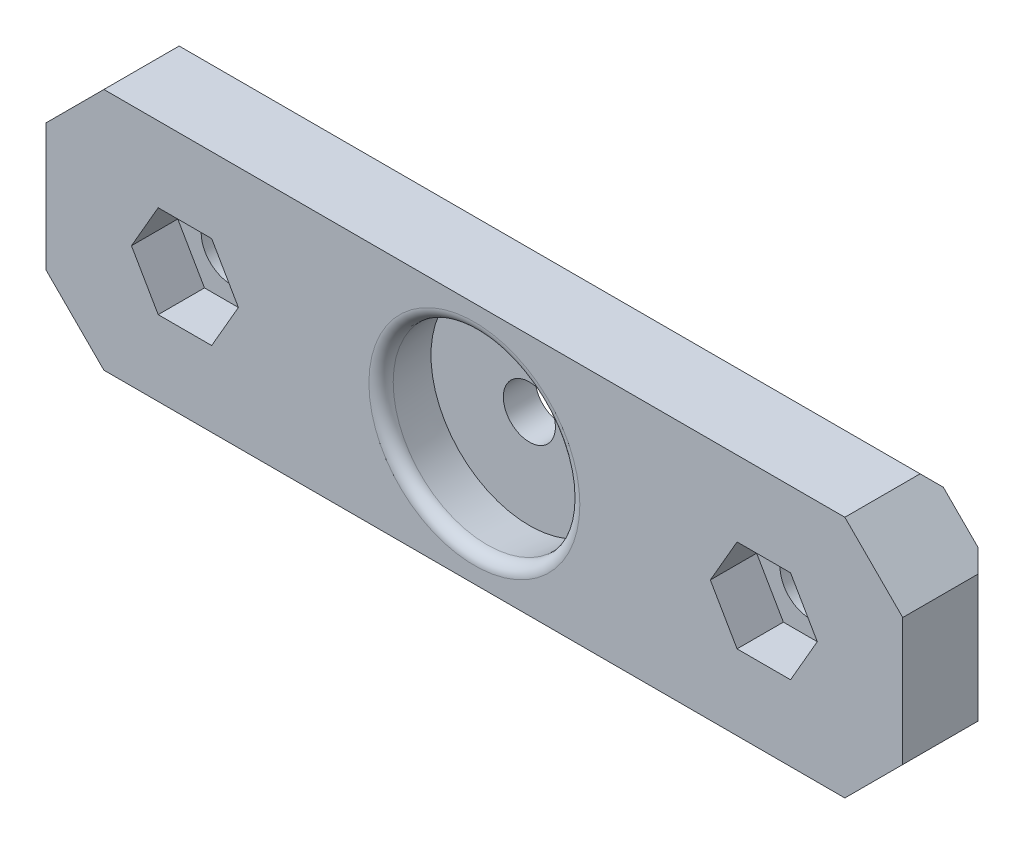
ISO-10303-21;
HEADER;
FILE_DESCRIPTION(('STEP AP214'),'2;1');
FILE_NAME('part.step','',(''),(''),'','','');
FILE_SCHEMA(('AUTOMOTIVE_DESIGN { 1 0 10303 214 1 1 1 1 }'));
ENDSEC;
DATA;
#1=APPLICATION_CONTEXT('core data for automotive mechanical design processes');
#2=APPLICATION_PROTOCOL_DEFINITION('international standard','automotive_design',2000,#1);
#3=PRODUCT_CONTEXT('',#1,'mechanical');
#4=PRODUCT('Part','Part','',(#3));
#5=PRODUCT_RELATED_PRODUCT_CATEGORY('part','',(#4));
#6=PRODUCT_DEFINITION_FORMATION('','',#4);
#7=PRODUCT_DEFINITION_CONTEXT('part definition',#1,'design');
#8=PRODUCT_DEFINITION('design','',#6,#7);
#9=PRODUCT_DEFINITION_SHAPE('','',#8);
#10=(LENGTH_UNIT() NAMED_UNIT(*) SI_UNIT(.MILLI.,.METRE.));
#11=(NAMED_UNIT(*) PLANE_ANGLE_UNIT() SI_UNIT($,.RADIAN.));
#12=(NAMED_UNIT(*) SI_UNIT($,.STERADIAN.) SOLID_ANGLE_UNIT());
#13=UNCERTAINTY_MEASURE_WITH_UNIT(LENGTH_MEASURE(1.E-05),#10,'distance_accuracy_value','');
#14=(GEOMETRIC_REPRESENTATION_CONTEXT(3) GLOBAL_UNCERTAINTY_ASSIGNED_CONTEXT((#13)) GLOBAL_UNIT_ASSIGNED_CONTEXT((#10,
#11,#12)) REPRESENTATION_CONTEXT('',''));
#15=CARTESIAN_POINT('',(0.,0.,0.));
#16=DIRECTION('',(0.,0.,1.));
#17=DIRECTION('',(1.,0.,0.));
#18=AXIS2_PLACEMENT_3D('',#15,#16,#17);
#19=CARTESIAN_POINT('',(-25.,0.,7.5));
#20=DIRECTION('',(0.,0.,-1.));
#21=DIRECTION('',(-1.,0.,0.));
#22=AXIS2_PLACEMENT_3D('',#19,#20,#21);
#23=CYLINDRICAL_SURFACE('',#22,2.6);
#24=CARTESIAN_POINT('',(-25.,0.,1.));
#25=DIRECTION('',(0.,0.,-1.));
#26=DIRECTION('',(-1.,0.,0.));
#27=AXIS2_PLACEMENT_3D('',#24,#25,#26);
#28=CIRCLE('',#27,2.6);
#29=CARTESIAN_POINT('',(-27.6,0.,1.));
#30=VERTEX_POINT('',#29);
#31=EDGE_CURVE('E362',#30,#30,#28,.T.);
#32=ORIENTED_EDGE('',*,*,#31,.T.);
#33=EDGE_LOOP('',(#32));
#34=FACE_BOUND('',#33,.T.);
#35=CARTESIAN_POINT('',(-25.,0.,3.5));
#36=DIRECTION('',(0.,0.,1.));
#37=DIRECTION('',(1.,0.,0.));
#38=AXIS2_PLACEMENT_3D('',#35,#36,#37);
#39=CIRCLE('',#38,2.6);
#40=CARTESIAN_POINT('',(-22.4,0.,3.5));
#41=VERTEX_POINT('',#40);
#42=EDGE_CURVE('E251',#41,#41,#39,.F.);
#43=ORIENTED_EDGE('',*,*,#42,.F.);
#44=EDGE_LOOP('',(#43));
#45=FACE_BOUND('',#44,.T.);
#46=ADVANCED_FACE('F33',(#34,#45),#23,.F.);
#47=CARTESIAN_POINT('',(25.,0.,7.5));
#48=DIRECTION('',(0.,0.,-1.));
#49=DIRECTION('',(-1.,0.,0.));
#50=AXIS2_PLACEMENT_3D('',#47,#48,#49);
#51=CYLINDRICAL_SURFACE('',#50,2.6);
#52=CARTESIAN_POINT('',(25.,0.,1.));
#53=DIRECTION('',(0.,0.,-1.));
#54=DIRECTION('',(-1.,0.,0.));
#55=AXIS2_PLACEMENT_3D('',#52,#53,#54);
#56=CIRCLE('',#55,2.6);
#57=CARTESIAN_POINT('',(22.4,0.,1.));
#58=VERTEX_POINT('',#57);
#59=EDGE_CURVE('E377',#58,#58,#56,.T.);
#60=ORIENTED_EDGE('',*,*,#59,.T.);
#61=EDGE_LOOP('',(#60));
#62=FACE_BOUND('',#61,.T.);
#63=CARTESIAN_POINT('',(25.,0.,3.5));
#64=DIRECTION('',(0.,0.,1.));
#65=DIRECTION('',(1.,0.,0.));
#66=AXIS2_PLACEMENT_3D('',#63,#64,#65);
#67=CIRCLE('',#66,2.6);
#68=CARTESIAN_POINT('',(27.6,0.,3.5));
#69=VERTEX_POINT('',#68);
#70=EDGE_CURVE('E297',#69,#69,#67,.F.);
#71=ORIENTED_EDGE('',*,*,#70,.F.);
#72=EDGE_LOOP('',(#71));
#73=FACE_BOUND('',#72,.T.);
#74=ADVANCED_FACE('F473',(#62,#73),#51,.F.);
#75=CARTESIAN_POINT('',(37.,-10.5,7.5));
#76=DIRECTION('',(-1.,0.,0.));
#77=DIRECTION('',(0.,0.,1.));
#78=AXIS2_PLACEMENT_3D('',#75,#76,#77);
#79=PLANE('',#78);
#80=DIRECTION('',(0.,0.,-1.));
#81=VECTOR('',#80,1.);
#82=CARTESIAN_POINT('',(37.,-5.49999999999999,7.5));
#83=LINE('',#82,#81);
#84=CARTESIAN_POINT('',(37.,-5.49999999999999,7.5));
#85=VERTEX_POINT('',#84);
#86=CARTESIAN_POINT('',(37.,-5.49999999999999,1.));
#87=VERTEX_POINT('',#86);
#88=EDGE_CURVE('E357',#85,#87,#83,.T.);
#89=ORIENTED_EDGE('',*,*,#88,.T.);
#90=DIRECTION('',(0.,1.,0.));
#91=VECTOR('',#90,1.);
#92=CARTESIAN_POINT('',(37.,5.49999999999997,1.));
#93=LINE('',#92,#91);
#94=CARTESIAN_POINT('',(37.,5.49999999999998,1.));
#95=VERTEX_POINT('',#94);
#96=EDGE_CURVE('E405',#87,#95,#93,.T.);
#97=ORIENTED_EDGE('',*,*,#96,.T.);
#98=DIRECTION('',(0.,0.,1.));
#99=VECTOR('',#98,1.);
#100=CARTESIAN_POINT('',(37.,5.49999999999998,7.5));
#101=LINE('',#100,#99);
#102=CARTESIAN_POINT('',(37.,5.49999999999997,7.5));
#103=VERTEX_POINT('',#102);
#104=EDGE_CURVE('E360',#95,#103,#101,.T.);
#105=ORIENTED_EDGE('',*,*,#104,.T.);
#106=DIRECTION('',(0.,1.,0.));
#107=VECTOR('',#106,1.);
#108=CARTESIAN_POINT('',(37.,-10.5,7.5));
#109=LINE('',#108,#107);
#110=EDGE_CURVE('E311',#85,#103,#109,.T.);
#111=ORIENTED_EDGE('',*,*,#110,.F.);
#112=EDGE_LOOP('',(#89,#97,#105,#111));
#113=FACE_BOUND('',#112,.T.);
#114=ADVANCED_FACE('F449',(#113),#79,.F.);
#115=CARTESIAN_POINT('',(-37.,10.5,7.5));
#116=DIRECTION('',(0.,-1.,0.));
#117=DIRECTION('',(0.,0.,-1.));
#118=AXIS2_PLACEMENT_3D('',#115,#116,#117);
#119=PLANE('',#118);
#120=DIRECTION('',(0.,0.,-1.));
#121=VECTOR('',#120,1.);
#122=CARTESIAN_POINT('',(32.,10.5,7.5));
#123=LINE('',#122,#121);
#124=CARTESIAN_POINT('',(32.,10.5,7.5));
#125=VERTEX_POINT('',#124);
#126=CARTESIAN_POINT('',(32.,10.5,0.999999999999995));
#127=VERTEX_POINT('',#126);
#128=EDGE_CURVE('E340',#125,#127,#123,.T.);
#129=ORIENTED_EDGE('',*,*,#128,.T.);
#130=DIRECTION('',(-1.,0.,0.));
#131=VECTOR('',#130,1.);
#132=CARTESIAN_POINT('',(-32.,10.5,0.999999999999994));
#133=LINE('',#132,#131);
#134=CARTESIAN_POINT('',(-32.,10.5,0.999999999999993));
#135=VERTEX_POINT('',#134);
#136=EDGE_CURVE('E41',#127,#135,#133,.T.);
#137=ORIENTED_EDGE('',*,*,#136,.T.);
#138=DIRECTION('',(0.,0.,1.));
#139=VECTOR('',#138,1.);
#140=CARTESIAN_POINT('',(-32.,10.5,7.5));
#141=LINE('',#140,#139);
#142=CARTESIAN_POINT('',(-32.,10.5,7.5));
#143=VERTEX_POINT('',#142);
#144=EDGE_CURVE('E342',#135,#143,#141,.T.);
#145=ORIENTED_EDGE('',*,*,#144,.T.);
#146=DIRECTION('',(-1.,0.,0.));
#147=VECTOR('',#146,1.);
#148=CARTESIAN_POINT('',(-37.,10.5,7.5));
#149=LINE('',#148,#147);
#150=EDGE_CURVE('E314',#125,#143,#149,.T.);
#151=ORIENTED_EDGE('',*,*,#150,.F.);
#152=EDGE_LOOP('',(#129,#137,#145,#151));
#153=FACE_BOUND('',#152,.T.);
#154=ADVANCED_FACE('F417',(#153),#119,.F.);
#155=CARTESIAN_POINT('',(-37.,-10.5,7.5));
#156=DIRECTION('',(1.,0.,0.));
#157=DIRECTION('',(0.,0.,-1.));
#158=AXIS2_PLACEMENT_3D('',#155,#156,#157);
#159=PLANE('',#158);
#160=DIRECTION('',(0.,0.,-1.));
#161=VECTOR('',#160,1.);
#162=CARTESIAN_POINT('',(-37.,5.5,7.5));
#163=LINE('',#162,#161);
#164=CARTESIAN_POINT('',(-37.,5.49999999999999,7.5));
#165=VERTEX_POINT('',#164);
#166=CARTESIAN_POINT('',(-37.,5.5,1.));
#167=VERTEX_POINT('',#166);
#168=EDGE_CURVE('E325',#165,#167,#163,.T.);
#169=ORIENTED_EDGE('',*,*,#168,.T.);
#170=DIRECTION('',(0.,-1.,0.));
#171=VECTOR('',#170,1.);
#172=CARTESIAN_POINT('',(-37.,-5.49999999999998,1.));
#173=LINE('',#172,#171);
#174=CARTESIAN_POINT('',(-37.,-5.49999999999997,1.));
#175=VERTEX_POINT('',#174);
#176=EDGE_CURVE('E386',#167,#175,#173,.T.);
#177=ORIENTED_EDGE('',*,*,#176,.T.);
#178=DIRECTION('',(0.,0.,1.));
#179=VECTOR('',#178,1.);
#180=CARTESIAN_POINT('',(-37.,-5.49999999999997,7.5));
#181=LINE('',#180,#179);
#182=CARTESIAN_POINT('',(-37.,-5.49999999999997,7.5));
#183=VERTEX_POINT('',#182);
#184=EDGE_CURVE('E323',#175,#183,#181,.T.);
#185=ORIENTED_EDGE('',*,*,#184,.T.);
#186=DIRECTION('',(0.,-1.,0.));
#187=VECTOR('',#186,1.);
#188=CARTESIAN_POINT('',(-37.,-10.5,7.5));
#189=LINE('',#188,#187);
#190=EDGE_CURVE('E317',#165,#183,#189,.T.);
#191=ORIENTED_EDGE('',*,*,#190,.F.);
#192=EDGE_LOOP('',(#169,#177,#185,#191));
#193=FACE_BOUND('',#192,.T.);
#194=ADVANCED_FACE('F430',(#193),#159,.F.);
#195=CARTESIAN_POINT('',(-37.,-10.5,7.5));
#196=DIRECTION('',(0.,1.,0.));
#197=DIRECTION('',(0.,0.,1.));
#198=AXIS2_PLACEMENT_3D('',#195,#196,#197);
#199=PLANE('',#198);
#200=DIRECTION('',(0.,0.,-1.));
#201=VECTOR('',#200,1.);
#202=CARTESIAN_POINT('',(-32.,-10.5,7.5));
#203=LINE('',#202,#201);
#204=CARTESIAN_POINT('',(-32.,-10.5,7.5));
#205=VERTEX_POINT('',#204);
#206=CARTESIAN_POINT('',(-32.,-10.5,0.999999999999993));
#207=VERTEX_POINT('',#206);
#208=EDGE_CURVE('E354',#205,#207,#203,.T.);
#209=ORIENTED_EDGE('',*,*,#208,.T.);
#210=DIRECTION('',(1.,0.,0.));
#211=VECTOR('',#210,1.);
#212=CARTESIAN_POINT('',(32.,-10.5,0.999999999999994));
#213=LINE('',#212,#211);
#214=CARTESIAN_POINT('',(32.,-10.5,0.999999999999993));
#215=VERTEX_POINT('',#214);
#216=EDGE_CURVE('E11',#207,#215,#213,.T.);
#217=ORIENTED_EDGE('',*,*,#216,.T.);
#218=DIRECTION('',(0.,0.,1.));
#219=VECTOR('',#218,1.);
#220=CARTESIAN_POINT('',(32.,-10.5,7.5));
#221=LINE('',#220,#219);
#222=CARTESIAN_POINT('',(32.,-10.5,7.5));
#223=VERTEX_POINT('',#222);
#224=EDGE_CURVE('E352',#215,#223,#221,.T.);
#225=ORIENTED_EDGE('',*,*,#224,.T.);
#226=DIRECTION('',(1.,0.,0.));
#227=VECTOR('',#226,1.);
#228=CARTESIAN_POINT('',(-37.,-10.5,7.5));
#229=LINE('',#228,#227);
#230=EDGE_CURVE('E320',#205,#223,#229,.T.);
#231=ORIENTED_EDGE('',*,*,#230,.F.);
#232=EDGE_LOOP('',(#209,#217,#225,#231));
#233=FACE_BOUND('',#232,.T.);
#234=ADVANCED_FACE('F440',(#233),#199,.F.);
#235=CARTESIAN_POINT('',(0.,0.,7.5));
#236=DIRECTION('',(0.,0.,-1.));
#237=DIRECTION('',(-1.,0.,0.));
#238=AXIS2_PLACEMENT_3D('',#235,#236,#237);
#239=PLANE('',#238);
#240=CARTESIAN_POINT('',(0.,0.,7.5));
#241=DIRECTION('',(0.,0.,-1.));
#242=DIRECTION('',(-1.,0.,0.));
#243=AXIS2_PLACEMENT_3D('',#240,#241,#242);
#244=CIRCLE('',#243,9.11061251482919);
#245=CARTESIAN_POINT('',(-9.11061251482919,0.,7.5));
#246=VERTEX_POINT('',#245);
#247=EDGE_CURVE('E383',#246,#246,#244,.T.);
#248=ORIENTED_EDGE('',*,*,#247,.T.);
#249=EDGE_LOOP('',(#248));
#250=FACE_BOUND('',#249,.T.);
#251=DIRECTION('',(1.,0.,0.));
#252=VECTOR('',#251,1.);
#253=CARTESIAN_POINT('',(-27.3094010767585,-4.,7.5));
#254=LINE('',#253,#252);
#255=CARTESIAN_POINT('',(-27.3094010767585,-4.,7.5));
#256=VERTEX_POINT('',#255);
#257=CARTESIAN_POINT('',(-22.6905989232415,-4.,7.5));
#258=VERTEX_POINT('',#257);
#259=EDGE_CURVE('E238',#256,#258,#254,.T.);
#260=ORIENTED_EDGE('',*,*,#259,.F.);
#261=DIRECTION('',(0.499999999999999,-0.866025403784439,0.));
#262=VECTOR('',#261,1.);
#263=CARTESIAN_POINT('',(-29.618802153517,0.,7.5));
#264=LINE('',#263,#262);
#265=CARTESIAN_POINT('',(-29.618802153517,0.,7.5));
#266=VERTEX_POINT('',#265);
#267=EDGE_CURVE('E203',#266,#256,#264,.T.);
#268=ORIENTED_EDGE('',*,*,#267,.F.);
#269=DIRECTION('',(-0.499999999999999,-0.866025403784439,0.));
#270=VECTOR('',#269,1.);
#271=CARTESIAN_POINT('',(-27.3094010767585,4.,7.5));
#272=LINE('',#271,#270);
#273=CARTESIAN_POINT('',(-27.3094010767585,4.,7.5));
#274=VERTEX_POINT('',#273);
#275=EDGE_CURVE('E222',#274,#266,#272,.T.);
#276=ORIENTED_EDGE('',*,*,#275,.F.);
#277=DIRECTION('',(-1.,0.,0.));
#278=VECTOR('',#277,1.);
#279=CARTESIAN_POINT('',(-22.6905989232415,4.,7.5));
#280=LINE('',#279,#278);
#281=CARTESIAN_POINT('',(-22.6905989232415,4.,7.5));
#282=VERTEX_POINT('',#281);
#283=EDGE_CURVE('E225',#282,#274,#280,.T.);
#284=ORIENTED_EDGE('',*,*,#283,.F.);
#285=DIRECTION('',(-0.5,0.866025403784439,0.));
#286=VECTOR('',#285,1.);
#287=CARTESIAN_POINT('',(-20.381197846483,0.,7.5));
#288=LINE('',#287,#286);
#289=CARTESIAN_POINT('',(-20.381197846483,0.,7.5));
#290=VERTEX_POINT('',#289);
#291=EDGE_CURVE('E244',#290,#282,#288,.T.);
#292=ORIENTED_EDGE('',*,*,#291,.F.);
#293=DIRECTION('',(0.5,0.866025403784439,0.));
#294=VECTOR('',#293,1.);
#295=CARTESIAN_POINT('',(-22.6905989232415,-4.,7.5));
#296=LINE('',#295,#294);
#297=EDGE_CURVE('E241',#258,#290,#296,.T.);
#298=ORIENTED_EDGE('',*,*,#297,.F.);
#299=EDGE_LOOP('',(#260,#268,#276,#284,#292,#298));
#300=FACE_BOUND('',#299,.T.);
#301=DIRECTION('',(1.,0.,0.));
#302=VECTOR('',#301,1.);
#303=CARTESIAN_POINT('',(22.6905989232415,-3.99999999999999,7.5));
#304=LINE('',#303,#302);
#305=CARTESIAN_POINT('',(22.6905989232415,-3.99999999999999,7.5));
#306=VERTEX_POINT('',#305);
#307=CARTESIAN_POINT('',(27.3094010767585,-3.99999999999999,7.5));
#308=VERTEX_POINT('',#307);
#309=EDGE_CURVE('E281',#306,#308,#304,.T.);
#310=ORIENTED_EDGE('',*,*,#309,.F.);
#311=DIRECTION('',(0.5,-0.866025403784439,0.));
#312=VECTOR('',#311,1.);
#313=CARTESIAN_POINT('',(20.381197846483,0.,7.5));
#314=LINE('',#313,#312);
#315=CARTESIAN_POINT('',(20.381197846483,0.,7.5));
#316=VERTEX_POINT('',#315);
#317=EDGE_CURVE('E279',#316,#306,#314,.T.);
#318=ORIENTED_EDGE('',*,*,#317,.F.);
#319=DIRECTION('',(-0.5,-0.866025403784439,0.));
#320=VECTOR('',#319,1.);
#321=CARTESIAN_POINT('',(22.6905989232415,4.,7.5));
#322=LINE('',#321,#320);
#323=CARTESIAN_POINT('',(22.6905989232415,4.,7.5));
#324=VERTEX_POINT('',#323);
#325=EDGE_CURVE('E263',#324,#316,#322,.T.);
#326=ORIENTED_EDGE('',*,*,#325,.F.);
#327=DIRECTION('',(-1.,0.,0.));
#328=VECTOR('',#327,1.);
#329=CARTESIAN_POINT('',(27.3094010767585,4.,7.5));
#330=LINE('',#329,#328);
#331=CARTESIAN_POINT('',(27.3094010767585,4.,7.5));
#332=VERTEX_POINT('',#331);
#333=EDGE_CURVE('E290',#332,#324,#330,.T.);
#334=ORIENTED_EDGE('',*,*,#333,.F.);
#335=DIRECTION('',(-0.5,0.866025403784439,0.));
#336=VECTOR('',#335,1.);
#337=CARTESIAN_POINT('',(29.618802153517,0.,7.5));
#338=LINE('',#337,#336);
#339=CARTESIAN_POINT('',(29.618802153517,0.,7.5));
#340=VERTEX_POINT('',#339);
#341=EDGE_CURVE('E287',#340,#332,#338,.T.);
#342=ORIENTED_EDGE('',*,*,#341,.F.);
#343=DIRECTION('',(0.5,0.866025403784438,0.));
#344=VECTOR('',#343,1.);
#345=CARTESIAN_POINT('',(27.3094010767585,-3.99999999999999,7.5));
#346=LINE('',#345,#344);
#347=EDGE_CURVE('E284',#308,#340,#346,.T.);
#348=ORIENTED_EDGE('',*,*,#347,.F.);
#349=EDGE_LOOP('',(#310,#318,#326,#334,#342,#348));
#350=FACE_BOUND('',#349,.T.);
#351=ORIENTED_EDGE('',*,*,#150,.T.);
#352=DIRECTION('',(0.707106781186549,0.707106781186547,0.));
#353=VECTOR('',#352,1.);
#354=CARTESIAN_POINT('',(-37.,5.5,7.5));
#355=LINE('',#354,#353);
#356=EDGE_CURVE('E350',#143,#165,#355,.F.);
#357=ORIENTED_EDGE('',*,*,#356,.T.);
#358=ORIENTED_EDGE('',*,*,#190,.T.);
#359=DIRECTION('',(-0.707106781186546,0.70710678118655,0.));
#360=VECTOR('',#359,1.);
#361=CARTESIAN_POINT('',(-32.,-10.5,7.5));
#362=LINE('',#361,#360);
#363=EDGE_CURVE('E348',#183,#205,#362,.F.);
#364=ORIENTED_EDGE('',*,*,#363,.T.);
#365=ORIENTED_EDGE('',*,*,#230,.T.);
#366=DIRECTION('',(-0.707106781186549,-0.707106781186547,0.));
#367=VECTOR('',#366,1.);
#368=CARTESIAN_POINT('',(37.,-5.49999999999999,7.5));
#369=LINE('',#368,#367);
#370=EDGE_CURVE('E344',#223,#85,#369,.F.);
#371=ORIENTED_EDGE('',*,*,#370,.T.);
#372=ORIENTED_EDGE('',*,*,#110,.T.);
#373=DIRECTION('',(0.707106781186545,-0.70710678118655,0.));
#374=VECTOR('',#373,1.);
#375=CARTESIAN_POINT('',(32.,10.5,7.5));
#376=LINE('',#375,#374);
#377=EDGE_CURVE('E346',#103,#125,#376,.F.);
#378=ORIENTED_EDGE('',*,*,#377,.T.);
#379=EDGE_LOOP('',(#351,#357,#358,#364,#365,#371,#372,#378));
#380=FACE_BOUND('',#379,.T.);
#381=ADVANCED_FACE('F427',(#250,#300,#350,#380),#239,.F.);
#382=CARTESIAN_POINT('',(0.,0.,0.));
#383=DIRECTION('',(0.,0.,-1.));
#384=DIRECTION('',(-1.,0.,0.));
#385=AXIS2_PLACEMENT_3D('',#382,#383,#384);
#386=PLANE('',#385);
#387=CARTESIAN_POINT('',(-25.,0.,0.));
#388=DIRECTION('',(0.,0.,-1.));
#389=DIRECTION('',(-1.,0.,0.));
#390=AXIS2_PLACEMENT_3D('',#387,#388,#389);
#391=CIRCLE('',#390,3.6);
#392=CARTESIAN_POINT('',(-28.6,0.,0.));
#393=VERTEX_POINT('',#392);
#394=EDGE_CURVE('E374',#393,#393,#391,.F.);
#395=ORIENTED_EDGE('',*,*,#394,.T.);
#396=EDGE_LOOP('',(#395));
#397=FACE_BOUND('',#396,.T.);
#398=CARTESIAN_POINT('',(25.,0.,0.));
#399=DIRECTION('',(0.,0.,-1.));
#400=DIRECTION('',(-1.,0.,0.));
#401=AXIS2_PLACEMENT_3D('',#398,#399,#400);
#402=CIRCLE('',#401,3.6);
#403=CARTESIAN_POINT('',(21.4,0.,0.));
#404=VERTEX_POINT('',#403);
#405=EDGE_CURVE('E371',#404,#404,#402,.F.);
#406=ORIENTED_EDGE('',*,*,#405,.T.);
#407=EDGE_LOOP('',(#406));
#408=FACE_BOUND('',#407,.T.);
#409=CARTESIAN_POINT('',(0.,0.,0.));
#410=DIRECTION('',(0.,0.,1.));
#411=DIRECTION('',(1.,0.,0.));
#412=AXIS2_PLACEMENT_3D('',#409,#410,#411);
#413=CIRCLE('',#412,2.25);
#414=CARTESIAN_POINT('',(2.25,0.,0.));
#415=VERTEX_POINT('',#414);
#416=EDGE_CURVE('E228',#415,#415,#413,.T.);
#417=ORIENTED_EDGE('',*,*,#416,.T.);
#418=EDGE_LOOP('',(#417));
#419=FACE_BOUND('',#418,.T.);
#420=DIRECTION('',(0.707106781186546,-0.70710678118655,0.));
#421=VECTOR('',#420,1.);
#422=CARTESIAN_POINT('',(-21.2500000000001,-21.25,0.));
#423=LINE('',#422,#421);
#424=CARTESIAN_POINT('',(-33.,-9.50000000000001,0.));
#425=VERTEX_POINT('',#424);
#426=CARTESIAN_POINT('',(-36.,-6.49999999999999,0.));
#427=VERTEX_POINT('',#426);
#428=EDGE_CURVE('E334',#425,#427,#423,.F.);
#429=ORIENTED_EDGE('',*,*,#428,.T.);
#430=DIRECTION('',(0.,1.,0.));
#431=VECTOR('',#430,1.);
#432=CARTESIAN_POINT('',(-36.,5.49999999999999,0.));
#433=LINE('',#432,#431);
#434=CARTESIAN_POINT('',(-36.,6.50000000000002,0.));
#435=VERTEX_POINT('',#434);
#436=EDGE_CURVE('E399',#427,#435,#433,.T.);
#437=ORIENTED_EDGE('',*,*,#436,.T.);
#438=DIRECTION('',(-0.707106781186549,-0.707106781186547,0.));
#439=VECTOR('',#438,1.);
#440=CARTESIAN_POINT('',(-21.2499999999999,21.25,0.));
#441=LINE('',#440,#439);
#442=CARTESIAN_POINT('',(-33.,9.50000000000001,0.));
#443=VERTEX_POINT('',#442);
#444=EDGE_CURVE('E337',#435,#443,#441,.F.);
#445=ORIENTED_EDGE('',*,*,#444,.T.);
#446=DIRECTION('',(1.,0.,0.));
#447=VECTOR('',#446,1.);
#448=CARTESIAN_POINT('',(32.,9.50000000000001,0.));
#449=LINE('',#448,#447);
#450=CARTESIAN_POINT('',(33.,9.50000000000001,0.));
#451=VERTEX_POINT('',#450);
#452=EDGE_CURVE('E395',#443,#451,#449,.T.);
#453=ORIENTED_EDGE('',*,*,#452,.T.);
#454=DIRECTION('',(-0.707106781186545,0.70710678118655,0.));
#455=VECTOR('',#454,1.);
#456=CARTESIAN_POINT('',(21.2500000000001,21.25,0.));
#457=LINE('',#456,#455);
#458=CARTESIAN_POINT('',(36.,6.49999999999998,0.));
#459=VERTEX_POINT('',#458);
#460=EDGE_CURVE('E331',#451,#459,#457,.F.);
#461=ORIENTED_EDGE('',*,*,#460,.T.);
#462=DIRECTION('',(0.,-1.,0.));
#463=VECTOR('',#462,1.);
#464=CARTESIAN_POINT('',(36.,-5.49999999999999,0.));
#465=LINE('',#464,#463);
#466=CARTESIAN_POINT('',(36.,-6.50000000000002,0.));
#467=VERTEX_POINT('',#466);
#468=EDGE_CURVE('E397',#459,#467,#465,.T.);
#469=ORIENTED_EDGE('',*,*,#468,.T.);
#470=DIRECTION('',(0.707106781186549,0.707106781186547,0.));
#471=VECTOR('',#470,1.);
#472=CARTESIAN_POINT('',(21.25,-21.25,0.));
#473=LINE('',#472,#471);
#474=CARTESIAN_POINT('',(33.,-9.5,0.));
#475=VERTEX_POINT('',#474);
#476=EDGE_CURVE('E328',#467,#475,#473,.F.);
#477=ORIENTED_EDGE('',*,*,#476,.T.);
#478=DIRECTION('',(-1.,0.,0.));
#479=VECTOR('',#478,1.);
#480=CARTESIAN_POINT('',(-32.,-9.50000000000001,0.));
#481=LINE('',#480,#479);
#482=EDGE_CURVE('E393',#475,#425,#481,.T.);
#483=ORIENTED_EDGE('',*,*,#482,.T.);
#484=EDGE_LOOP('',(#429,#437,#445,#453,#461,#469,#477,#483));
#485=FACE_BOUND('',#484,.T.);
#486=ADVANCED_FACE('F456',(#397,#408,#419,#485),#386,.T.);
#487=CARTESIAN_POINT('',(0.,0.,7.5));
#488=DIRECTION('',(0.,0.,-1.));
#489=DIRECTION('',(1.,0.,0.));
#490=AXIS2_PLACEMENT_3D('',#487,#488,#489);
#491=CONICAL_SURFACE('',#490,8.,0.10471975511966);
#492=CARTESIAN_POINT('',(0.,0.,6.39547153673234));
#493=DIRECTION('',(0.,0.,1.));
#494=DIRECTION('',(1.,0.,0.));
#495=AXIS2_PLACEMENT_3D('',#492,#493,#494);
#496=CIRCLE('',#495,8.11609061946092);
#497=CARTESIAN_POINT('',(8.11609061946092,0.,6.39547153673234));
#498=VERTEX_POINT('',#497);
#499=EDGE_CURVE('E380',#498,#498,#496,.T.);
#500=ORIENTED_EDGE('',*,*,#499,.T.);
#501=EDGE_LOOP('',(#500));
#502=FACE_BOUND('',#501,.T.);
#503=CARTESIAN_POINT('',(0.,0.,2.75));
#504=DIRECTION('',(0.,0.,1.));
#505=DIRECTION('',(1.,0.,0.));
#506=AXIS2_PLACEMENT_3D('',#503,#504,#505);
#507=CIRCLE('',#506,8.49924511751196);
#508=CARTESIAN_POINT('',(8.49924511751196,0.,2.75));
#509=VERTEX_POINT('',#508);
#510=EDGE_CURVE('E308',#509,#509,#507,.T.);
#511=ORIENTED_EDGE('',*,*,#510,.F.);
#512=EDGE_LOOP('',(#511));
#513=FACE_BOUND('',#512,.T.);
#514=ADVANCED_FACE('F489',(#502,#513),#491,.F.);
#515=CARTESIAN_POINT('',(0.,0.,2.75));
#516=DIRECTION('',(0.,0.,1.));
#517=DIRECTION('',(1.,0.,0.));
#518=AXIS2_PLACEMENT_3D('',#515,#516,#517);
#519=PLANE('',#518);
#520=CARTESIAN_POINT('',(0.,0.,2.75));
#521=DIRECTION('',(0.,0.,1.));
#522=DIRECTION('',(1.,0.,0.));
#523=AXIS2_PLACEMENT_3D('',#520,#521,#522);
#524=CIRCLE('',#523,2.25);
#525=CARTESIAN_POINT('',(2.25,0.,2.75));
#526=VERTEX_POINT('',#525);
#527=EDGE_CURVE('E239',#526,#526,#524,.T.);
#528=ORIENTED_EDGE('',*,*,#527,.F.);
#529=EDGE_LOOP('',(#528));
#530=FACE_BOUND('',#529,.T.);
#531=ORIENTED_EDGE('',*,*,#510,.T.);
#532=EDGE_LOOP('',(#531));
#533=FACE_BOUND('',#532,.T.);
#534=ADVANCED_FACE('F486',(#530,#533),#519,.T.);
#535=CARTESIAN_POINT('',(-37.,5.5,7.5));
#536=DIRECTION('',(0.707106781186547,-0.707106781186549,0.));
#537=DIRECTION('',(0.,0.,-1.));
#538=AXIS2_PLACEMENT_3D('',#535,#536,#537);
#539=PLANE('',#538);
#540=ORIENTED_EDGE('',*,*,#444,.F.);
#541=DIRECTION('',(0.577350269189628,0.577350269189626,-0.577350269189624));
#542=VECTOR('',#541,1.);
#543=CARTESIAN_POINT('',(-39.1666666666667,3.33333333333334,3.16666666666665));
#544=LINE('',#543,#542);
#545=EDGE_CURVE('E403',#435,#167,#544,.F.);
#546=ORIENTED_EDGE('',*,*,#545,.T.);
#547=ORIENTED_EDGE('',*,*,#168,.F.);
#548=ORIENTED_EDGE('',*,*,#356,.F.);
#549=ORIENTED_EDGE('',*,*,#144,.F.);
#550=DIRECTION('',(0.577350269189627,0.577350269189625,0.577350269189625));
#551=VECTOR('',#550,1.);
#552=CARTESIAN_POINT('',(-33.1666666666667,9.33333333333333,-0.16666666666668));
#553=LINE('',#552,#551);
#554=EDGE_CURVE('E401',#135,#443,#553,.F.);
#555=ORIENTED_EDGE('',*,*,#554,.T.);
#556=EDGE_LOOP('',(#540,#546,#547,#548,#549,#555));
#557=FACE_BOUND('',#556,.T.);
#558=ADVANCED_FACE('F423',(#557),#539,.F.);
#559=CARTESIAN_POINT('',(-32.,-10.5,7.5));
#560=DIRECTION('',(0.70710678118655,0.707106781186546,0.));
#561=DIRECTION('',(0.,0.,-1.));
#562=AXIS2_PLACEMENT_3D('',#559,#560,#561);
#563=PLANE('',#562);
#564=ORIENTED_EDGE('',*,*,#184,.F.);
#565=DIRECTION('',(-0.577350269189626,0.577350269189629,0.577350269189622));
#566=VECTOR('',#565,1.);
#567=CARTESIAN_POINT('',(-35.8333333333333,-6.66666666666668,-0.166666666666691));
#568=LINE('',#567,#566);
#569=EDGE_CURVE('E391',#175,#427,#568,.F.);
#570=ORIENTED_EDGE('',*,*,#569,.T.);
#571=ORIENTED_EDGE('',*,*,#428,.F.);
#572=DIRECTION('',(-0.577350269189624,0.577350269189627,-0.577350269189627));
#573=VECTOR('',#572,1.);
#574=CARTESIAN_POINT('',(-29.8333333333333,-12.6666666666667,3.16666666666667));
#575=LINE('',#574,#573);
#576=EDGE_CURVE('E389',#425,#207,#575,.F.);
#577=ORIENTED_EDGE('',*,*,#576,.T.);
#578=ORIENTED_EDGE('',*,*,#208,.F.);
#579=ORIENTED_EDGE('',*,*,#363,.F.);
#580=EDGE_LOOP('',(#564,#570,#571,#577,#578,#579));
#581=FACE_BOUND('',#580,.T.);
#582=ADVANCED_FACE('F434',(#581),#563,.F.);
#583=CARTESIAN_POINT('',(32.,10.5,7.5));
#584=DIRECTION('',(-0.70710678118655,-0.707106781186545,0.));
#585=DIRECTION('',(0.,0.,-1.));
#586=AXIS2_PLACEMENT_3D('',#583,#584,#585);
#587=PLANE('',#586);
#588=ORIENTED_EDGE('',*,*,#104,.F.);
#589=DIRECTION('',(0.577350269189626,-0.57735026918963,0.577350269189622));
#590=VECTOR('',#589,1.);
#591=CARTESIAN_POINT('',(35.8333333333333,6.66666666666669,-0.166666666666687));
#592=LINE('',#591,#590);
#593=EDGE_CURVE('E409',#95,#459,#592,.F.);
#594=ORIENTED_EDGE('',*,*,#593,.T.);
#595=ORIENTED_EDGE('',*,*,#460,.F.);
#596=DIRECTION('',(0.577350269189623,-0.577350269189627,-0.577350269189627));
#597=VECTOR('',#596,1.);
#598=CARTESIAN_POINT('',(29.8333333333333,12.6666666666667,3.16666666666667));
#599=LINE('',#598,#597);
#600=EDGE_CURVE('E55',#451,#127,#599,.F.);
#601=ORIENTED_EDGE('',*,*,#600,.T.);
#602=ORIENTED_EDGE('',*,*,#128,.F.);
#603=ORIENTED_EDGE('',*,*,#377,.F.);
#604=EDGE_LOOP('',(#588,#594,#595,#601,#602,#603));
#605=FACE_BOUND('',#604,.T.);
#606=ADVANCED_FACE('F452',(#605),#587,.F.);
#607=CARTESIAN_POINT('',(37.,-5.49999999999999,7.5));
#608=DIRECTION('',(-0.707106781186547,0.707106781186549,0.));
#609=DIRECTION('',(0.,0.,-1.));
#610=AXIS2_PLACEMENT_3D('',#607,#608,#609);
#611=PLANE('',#610);
#612=ORIENTED_EDGE('',*,*,#476,.F.);
#613=DIRECTION('',(-0.577350269189628,-0.577350269189626,-0.577350269189624));
#614=VECTOR('',#613,1.);
#615=CARTESIAN_POINT('',(39.1666666666667,-3.33333333333334,3.16666666666665));
#616=LINE('',#615,#614);
#617=EDGE_CURVE('E412',#467,#87,#616,.F.);
#618=ORIENTED_EDGE('',*,*,#617,.T.);
#619=ORIENTED_EDGE('',*,*,#88,.F.);
#620=ORIENTED_EDGE('',*,*,#370,.F.);
#621=ORIENTED_EDGE('',*,*,#224,.F.);
#622=DIRECTION('',(-0.577350269189627,-0.577350269189625,0.577350269189625));
#623=VECTOR('',#622,1.);
#624=CARTESIAN_POINT('',(33.1666666666667,-9.33333333333332,-0.16666666666668));
#625=LINE('',#624,#623);
#626=EDGE_CURVE('E48',#215,#475,#625,.F.);
#627=ORIENTED_EDGE('',*,*,#626,.T.);
#628=EDGE_LOOP('',(#612,#618,#619,#620,#621,#627));
#629=FACE_BOUND('',#628,.T.);
#630=ADVANCED_FACE('F444',(#629),#611,.F.);
#631=CARTESIAN_POINT('',(0.,0.,3.5));
#632=DIRECTION('',(0.,0.,1.));
#633=DIRECTION('',(1.,0.,0.));
#634=AXIS2_PLACEMENT_3D('',#631,#632,#633);
#635=PLANE('',#634);
#636=DIRECTION('',(0.5,-0.866025403784439,0.));
#637=VECTOR('',#636,1.);
#638=CARTESIAN_POINT('',(20.381197846483,0.,3.5));
#639=LINE('',#638,#637);
#640=CARTESIAN_POINT('',(20.381197846483,0.,3.5));
#641=VERTEX_POINT('',#640);
#642=CARTESIAN_POINT('',(22.6905989232415,-3.99999999999999,3.5));
#643=VERTEX_POINT('',#642);
#644=EDGE_CURVE('E259',#641,#643,#639,.T.);
#645=ORIENTED_EDGE('',*,*,#644,.T.);
#646=DIRECTION('',(1.,0.,0.));
#647=VECTOR('',#646,1.);
#648=CARTESIAN_POINT('',(22.6905989232415,-3.99999999999999,3.5));
#649=LINE('',#648,#647);
#650=CARTESIAN_POINT('',(27.3094010767585,-3.99999999999999,3.5));
#651=VERTEX_POINT('',#650);
#652=EDGE_CURVE('E262',#643,#651,#649,.T.);
#653=ORIENTED_EDGE('',*,*,#652,.T.);
#654=DIRECTION('',(0.5,0.866025403784438,0.));
#655=VECTOR('',#654,1.);
#656=CARTESIAN_POINT('',(27.3094010767585,-3.99999999999999,3.5));
#657=LINE('',#656,#655);
#658=CARTESIAN_POINT('',(29.618802153517,0.,3.5));
#659=VERTEX_POINT('',#658);
#660=EDGE_CURVE('E266',#651,#659,#657,.T.);
#661=ORIENTED_EDGE('',*,*,#660,.T.);
#662=DIRECTION('',(-0.5,0.866025403784439,0.));
#663=VECTOR('',#662,1.);
#664=CARTESIAN_POINT('',(29.618802153517,0.,3.5));
#665=LINE('',#664,#663);
#666=CARTESIAN_POINT('',(27.3094010767585,4.,3.5));
#667=VERTEX_POINT('',#666);
#668=EDGE_CURVE('E269',#659,#667,#665,.T.);
#669=ORIENTED_EDGE('',*,*,#668,.T.);
#670=DIRECTION('',(-1.,0.,0.));
#671=VECTOR('',#670,1.);
#672=CARTESIAN_POINT('',(27.3094010767585,4.,3.5));
#673=LINE('',#672,#671);
#674=CARTESIAN_POINT('',(22.6905989232415,4.,3.5));
#675=VERTEX_POINT('',#674);
#676=EDGE_CURVE('E272',#667,#675,#673,.T.);
#677=ORIENTED_EDGE('',*,*,#676,.T.);
#678=DIRECTION('',(-0.5,-0.866025403784439,0.));
#679=VECTOR('',#678,1.);
#680=CARTESIAN_POINT('',(22.6905989232415,4.,3.5));
#681=LINE('',#680,#679);
#682=EDGE_CURVE('E275',#675,#641,#681,.T.);
#683=ORIENTED_EDGE('',*,*,#682,.T.);
#684=EDGE_LOOP('',(#645,#653,#661,#669,#677,#683));
#685=FACE_BOUND('',#684,.T.);
#686=ORIENTED_EDGE('',*,*,#70,.T.);
#687=EDGE_LOOP('',(#686));
#688=FACE_BOUND('',#687,.T.);
#689=ADVANCED_FACE('F516',(#685,#688),#635,.T.);
#690=CARTESIAN_POINT('',(20.381197846483,0.,3.5));
#691=DIRECTION('',(-0.866025403784439,-0.5,0.));
#692=DIRECTION('',(0.5,-0.866025403784439,0.));
#693=AXIS2_PLACEMENT_3D('',#690,#691,#692);
#694=PLANE('',#693);
#695=ORIENTED_EDGE('',*,*,#317,.T.);
#696=DIRECTION('',(0.,0.,1.));
#697=VECTOR('',#696,1.);
#698=CARTESIAN_POINT('',(22.6905989232415,-3.99999999999999,3.5));
#699=LINE('',#698,#697);
#700=EDGE_CURVE('E278',#643,#306,#699,.T.);
#701=ORIENTED_EDGE('',*,*,#700,.F.);
#702=ORIENTED_EDGE('',*,*,#644,.F.);
#703=DIRECTION('',(0.,0.,1.));
#704=VECTOR('',#703,1.);
#705=CARTESIAN_POINT('',(20.381197846483,0.,3.5));
#706=LINE('',#705,#704);
#707=EDGE_CURVE('E295',#641,#316,#706,.T.);
#708=ORIENTED_EDGE('',*,*,#707,.T.);
#709=EDGE_LOOP('',(#695,#701,#702,#708));
#710=FACE_BOUND('',#709,.T.);
#711=ADVANCED_FACE('F483',(#710),#694,.F.);
#712=CARTESIAN_POINT('',(22.6905989232415,4.,3.5));
#713=DIRECTION('',(-0.866025403784439,0.499999999999999,0.));
#714=DIRECTION('',(-0.499999999999999,-0.866025403784439,0.));
#715=AXIS2_PLACEMENT_3D('',#712,#713,#714);
#716=PLANE('',#715);
#717=ORIENTED_EDGE('',*,*,#325,.T.);
#718=ORIENTED_EDGE('',*,*,#707,.F.);
#719=ORIENTED_EDGE('',*,*,#682,.F.);
#720=DIRECTION('',(0.,0.,1.));
#721=VECTOR('',#720,1.);
#722=CARTESIAN_POINT('',(22.6905989232415,4.,3.5));
#723=LINE('',#722,#721);
#724=EDGE_CURVE('E298',#675,#324,#723,.T.);
#725=ORIENTED_EDGE('',*,*,#724,.T.);
#726=EDGE_LOOP('',(#717,#718,#719,#725));
#727=FACE_BOUND('',#726,.T.);
#728=ADVANCED_FACE('F673',(#727),#716,.F.);
#729=CARTESIAN_POINT('',(27.3094010767585,4.,3.5));
#730=DIRECTION('',(0.,1.,0.));
#731=DIRECTION('',(-1.,0.,0.));
#732=AXIS2_PLACEMENT_3D('',#729,#730,#731);
#733=PLANE('',#732);
#734=ORIENTED_EDGE('',*,*,#333,.T.);
#735=ORIENTED_EDGE('',*,*,#724,.F.);
#736=ORIENTED_EDGE('',*,*,#676,.F.);
#737=DIRECTION('',(0.,0.,1.));
#738=VECTOR('',#737,1.);
#739=CARTESIAN_POINT('',(27.3094010767585,4.,3.5));
#740=LINE('',#739,#738);
#741=EDGE_CURVE('E300',#667,#332,#740,.T.);
#742=ORIENTED_EDGE('',*,*,#741,.T.);
#743=EDGE_LOOP('',(#734,#735,#736,#742));
#744=FACE_BOUND('',#743,.T.);
#745=ADVANCED_FACE('F664',(#744),#733,.F.);
#746=CARTESIAN_POINT('',(29.618802153517,0.,3.5));
#747=DIRECTION('',(0.866025403784439,0.5,0.));
#748=DIRECTION('',(-0.5,0.866025403784439,0.));
#749=AXIS2_PLACEMENT_3D('',#746,#747,#748);
#750=PLANE('',#749);
#751=ORIENTED_EDGE('',*,*,#341,.T.);
#752=ORIENTED_EDGE('',*,*,#741,.F.);
#753=ORIENTED_EDGE('',*,*,#668,.F.);
#754=DIRECTION('',(0.,0.,1.));
#755=VECTOR('',#754,1.);
#756=CARTESIAN_POINT('',(29.618802153517,0.,3.5));
#757=LINE('',#756,#755);
#758=EDGE_CURVE('E302',#659,#340,#757,.T.);
#759=ORIENTED_EDGE('',*,*,#758,.T.);
#760=EDGE_LOOP('',(#751,#752,#753,#759));
#761=FACE_BOUND('',#760,.T.);
#762=ADVANCED_FACE('F655',(#761),#750,.F.);
#763=CARTESIAN_POINT('',(27.3094010767585,-3.99999999999999,3.5));
#764=DIRECTION('',(0.866025403784439,-0.5,0.));
#765=DIRECTION('',(0.5,0.866025403784438,0.));
#766=AXIS2_PLACEMENT_3D('',#763,#764,#765);
#767=PLANE('',#766);
#768=ORIENTED_EDGE('',*,*,#347,.T.);
#769=ORIENTED_EDGE('',*,*,#758,.F.);
#770=ORIENTED_EDGE('',*,*,#660,.F.);
#771=DIRECTION('',(0.,0.,1.));
#772=VECTOR('',#771,1.);
#773=CARTESIAN_POINT('',(27.3094010767585,-3.99999999999999,3.5));
#774=LINE('',#773,#772);
#775=EDGE_CURVE('E304',#651,#308,#774,.T.);
#776=ORIENTED_EDGE('',*,*,#775,.T.);
#777=EDGE_LOOP('',(#768,#769,#770,#776));
#778=FACE_BOUND('',#777,.T.);
#779=ADVANCED_FACE('F647',(#778),#767,.F.);
#780=CARTESIAN_POINT('',(22.6905989232415,-3.99999999999999,3.5));
#781=DIRECTION('',(0.,-1.,0.));
#782=DIRECTION('',(0.,0.,-1.));
#783=AXIS2_PLACEMENT_3D('',#780,#781,#782);
#784=PLANE('',#783);
#785=ORIENTED_EDGE('',*,*,#309,.T.);
#786=ORIENTED_EDGE('',*,*,#775,.F.);
#787=ORIENTED_EDGE('',*,*,#652,.F.);
#788=ORIENTED_EDGE('',*,*,#700,.T.);
#789=EDGE_LOOP('',(#785,#786,#787,#788));
#790=FACE_BOUND('',#789,.T.);
#791=ADVANCED_FACE('F639',(#790),#784,.F.);
#792=CARTESIAN_POINT('',(0.,0.,3.5));
#793=DIRECTION('',(0.,0.,1.));
#794=DIRECTION('',(1.,0.,0.));
#795=AXIS2_PLACEMENT_3D('',#792,#793,#794);
#796=PLANE('',#795);
#797=DIRECTION('',(0.499999999999999,-0.866025403784439,0.));
#798=VECTOR('',#797,1.);
#799=CARTESIAN_POINT('',(-29.618802153517,0.,3.5));
#800=LINE('',#799,#798);
#801=CARTESIAN_POINT('',(-29.618802153517,0.,3.5));
#802=VERTEX_POINT('',#801);
#803=CARTESIAN_POINT('',(-27.3094010767585,-4.,3.5));
#804=VERTEX_POINT('',#803);
#805=EDGE_CURVE('E200',#802,#804,#800,.T.);
#806=ORIENTED_EDGE('',*,*,#805,.T.);
#807=DIRECTION('',(1.,0.,0.));
#808=VECTOR('',#807,1.);
#809=CARTESIAN_POINT('',(-27.3094010767585,-4.,3.5));
#810=LINE('',#809,#808);
#811=CARTESIAN_POINT('',(-22.6905989232415,-4.,3.5));
#812=VERTEX_POINT('',#811);
#813=EDGE_CURVE('E211',#804,#812,#810,.T.);
#814=ORIENTED_EDGE('',*,*,#813,.T.);
#815=DIRECTION('',(0.5,0.866025403784439,0.));
#816=VECTOR('',#815,1.);
#817=CARTESIAN_POINT('',(-22.6905989232415,-4.,3.5));
#818=LINE('',#817,#816);
#819=CARTESIAN_POINT('',(-20.381197846483,0.,3.5));
#820=VERTEX_POINT('',#819);
#821=EDGE_CURVE('E216',#812,#820,#818,.T.);
#822=ORIENTED_EDGE('',*,*,#821,.T.);
#823=DIRECTION('',(-0.5,0.866025403784439,0.));
#824=VECTOR('',#823,1.);
#825=CARTESIAN_POINT('',(-20.381197846483,0.,3.5));
#826=LINE('',#825,#824);
#827=CARTESIAN_POINT('',(-22.6905989232415,4.,3.5));
#828=VERTEX_POINT('',#827);
#829=EDGE_CURVE('E231',#820,#828,#826,.T.);
#830=ORIENTED_EDGE('',*,*,#829,.T.);
#831=DIRECTION('',(-1.,0.,0.));
#832=VECTOR('',#831,1.);
#833=CARTESIAN_POINT('',(-22.6905989232415,4.,3.5));
#834=LINE('',#833,#832);
#835=CARTESIAN_POINT('',(-27.3094010767585,4.,3.5));
#836=VERTEX_POINT('',#835);
#837=EDGE_CURVE('E234',#828,#836,#834,.T.);
#838=ORIENTED_EDGE('',*,*,#837,.T.);
#839=DIRECTION('',(-0.499999999999999,-0.866025403784439,0.));
#840=VECTOR('',#839,1.);
#841=CARTESIAN_POINT('',(-27.3094010767585,4.,3.5));
#842=LINE('',#841,#840);
#843=EDGE_CURVE('E208',#836,#802,#842,.T.);
#844=ORIENTED_EDGE('',*,*,#843,.T.);
#845=EDGE_LOOP('',(#806,#814,#822,#830,#838,#844));
#846=FACE_BOUND('',#845,.T.);
#847=ORIENTED_EDGE('',*,*,#42,.T.);
#848=EDGE_LOOP('',(#847));
#849=FACE_BOUND('',#848,.T.);
#850=ADVANCED_FACE('F218',(#846,#849),#796,.T.);
#851=CARTESIAN_POINT('',(-29.618802153517,0.,3.5));
#852=DIRECTION('',(-0.866025403784439,-0.499999999999999,0.));
#853=DIRECTION('',(0.5,-0.866025403784439,0.));
#854=AXIS2_PLACEMENT_3D('',#851,#852,#853);
#855=PLANE('',#854);
#856=ORIENTED_EDGE('',*,*,#267,.T.);
#857=DIRECTION('',(0.,0.,1.));
#858=VECTOR('',#857,1.);
#859=CARTESIAN_POINT('',(-27.3094010767585,-4.,3.5));
#860=LINE('',#859,#858);
#861=EDGE_CURVE('E196',#804,#256,#860,.T.);
#862=ORIENTED_EDGE('',*,*,#861,.F.);
#863=ORIENTED_EDGE('',*,*,#805,.F.);
#864=DIRECTION('',(0.,0.,1.));
#865=VECTOR('',#864,1.);
#866=CARTESIAN_POINT('',(-29.618802153517,0.,3.5));
#867=LINE('',#866,#865);
#868=EDGE_CURVE('E249',#802,#266,#867,.T.);
#869=ORIENTED_EDGE('',*,*,#868,.T.);
#870=EDGE_LOOP('',(#856,#862,#863,#869));
#871=FACE_BOUND('',#870,.T.);
#872=ADVANCED_FACE('F198',(#871),#855,.F.);
#873=CARTESIAN_POINT('',(-27.3094010767585,4.,3.5));
#874=DIRECTION('',(-0.866025403784439,0.499999999999999,0.));
#875=DIRECTION('',(-0.499999999999999,-0.866025403784439,0.));
#876=AXIS2_PLACEMENT_3D('',#873,#874,#875);
#877=PLANE('',#876);
#878=ORIENTED_EDGE('',*,*,#275,.T.);
#879=ORIENTED_EDGE('',*,*,#868,.F.);
#880=ORIENTED_EDGE('',*,*,#843,.F.);
#881=DIRECTION('',(0.,0.,1.));
#882=VECTOR('',#881,1.);
#883=CARTESIAN_POINT('',(-27.3094010767585,4.,3.5));
#884=LINE('',#883,#882);
#885=EDGE_CURVE('E252',#836,#274,#884,.T.);
#886=ORIENTED_EDGE('',*,*,#885,.T.);
#887=EDGE_LOOP('',(#878,#879,#880,#886));
#888=FACE_BOUND('',#887,.T.);
#889=ADVANCED_FACE('F615',(#888),#877,.F.);
#890=CARTESIAN_POINT('',(-22.6905989232415,4.,3.5));
#891=DIRECTION('',(0.,1.,0.));
#892=DIRECTION('',(-1.,0.,0.));
#893=AXIS2_PLACEMENT_3D('',#890,#891,#892);
#894=PLANE('',#893);
#895=ORIENTED_EDGE('',*,*,#283,.T.);
#896=ORIENTED_EDGE('',*,*,#885,.F.);
#897=ORIENTED_EDGE('',*,*,#837,.F.);
#898=DIRECTION('',(0.,0.,1.));
#899=VECTOR('',#898,1.);
#900=CARTESIAN_POINT('',(-22.6905989232415,4.,3.5));
#901=LINE('',#900,#899);
#902=EDGE_CURVE('E254',#828,#282,#901,.T.);
#903=ORIENTED_EDGE('',*,*,#902,.T.);
#904=EDGE_LOOP('',(#895,#896,#897,#903));
#905=FACE_BOUND('',#904,.T.);
#906=ADVANCED_FACE('F606',(#905),#894,.F.);
#907=CARTESIAN_POINT('',(-20.381197846483,0.,3.5));
#908=DIRECTION('',(0.866025403784439,0.5,0.));
#909=DIRECTION('',(-0.5,0.866025403784439,0.));
#910=AXIS2_PLACEMENT_3D('',#907,#908,#909);
#911=PLANE('',#910);
#912=ORIENTED_EDGE('',*,*,#291,.T.);
#913=ORIENTED_EDGE('',*,*,#902,.F.);
#914=ORIENTED_EDGE('',*,*,#829,.F.);
#915=DIRECTION('',(0.,0.,1.));
#916=VECTOR('',#915,1.);
#917=CARTESIAN_POINT('',(-20.381197846483,0.,3.5));
#918=LINE('',#917,#916);
#919=EDGE_CURVE('E256',#820,#290,#918,.T.);
#920=ORIENTED_EDGE('',*,*,#919,.T.);
#921=EDGE_LOOP('',(#912,#913,#914,#920));
#922=FACE_BOUND('',#921,.T.);
#923=ADVANCED_FACE('F597',(#922),#911,.F.);
#924=CARTESIAN_POINT('',(-22.6905989232415,-4.,3.5));
#925=DIRECTION('',(0.866025403784439,-0.5,0.));
#926=DIRECTION('',(0.5,0.866025403784439,0.));
#927=AXIS2_PLACEMENT_3D('',#924,#925,#926);
#928=PLANE('',#927);
#929=ORIENTED_EDGE('',*,*,#297,.T.);
#930=ORIENTED_EDGE('',*,*,#919,.F.);
#931=ORIENTED_EDGE('',*,*,#821,.F.);
#932=DIRECTION('',(0.,0.,1.));
#933=VECTOR('',#932,1.);
#934=CARTESIAN_POINT('',(-22.6905989232415,-4.,3.5));
#935=LINE('',#934,#933);
#936=EDGE_CURVE('E207',#812,#258,#935,.T.);
#937=ORIENTED_EDGE('',*,*,#936,.T.);
#938=EDGE_LOOP('',(#929,#930,#931,#937));
#939=FACE_BOUND('',#938,.T.);
#940=ADVANCED_FACE('F589',(#939),#928,.F.);
#941=CARTESIAN_POINT('',(-27.3094010767585,-4.,3.5));
#942=DIRECTION('',(0.,-1.,0.));
#943=DIRECTION('',(0.,0.,-1.));
#944=AXIS2_PLACEMENT_3D('',#941,#942,#943);
#945=PLANE('',#944);
#946=ORIENTED_EDGE('',*,*,#259,.T.);
#947=ORIENTED_EDGE('',*,*,#936,.F.);
#948=ORIENTED_EDGE('',*,*,#813,.F.);
#949=ORIENTED_EDGE('',*,*,#861,.T.);
#950=EDGE_LOOP('',(#946,#947,#948,#949));
#951=FACE_BOUND('',#950,.T.);
#952=ADVANCED_FACE('F212',(#951),#945,.F.);
#953=CARTESIAN_POINT('',(0.,0.,0.));
#954=DIRECTION('',(0.,0.,1.));
#955=DIRECTION('',(1.,0.,0.));
#956=AXIS2_PLACEMENT_3D('',#953,#954,#955);
#957=CYLINDRICAL_SURFACE('',#956,2.25);
#958=ORIENTED_EDGE('',*,*,#527,.T.);
#959=EDGE_LOOP('',(#958));
#960=FACE_BOUND('',#959,.T.);
#961=ORIENTED_EDGE('',*,*,#416,.F.);
#962=EDGE_LOOP('',(#961));
#963=FACE_BOUND('',#962,.T.);
#964=ADVANCED_FACE('F521',(#960,#963),#957,.F.);
#965=CARTESIAN_POINT('',(-25.,0.,1.));
#966=DIRECTION('',(0.,0.,-1.));
#967=DIRECTION('',(-1.,0.,0.));
#968=AXIS2_PLACEMENT_3D('',#965,#966,#967);
#969=TOROIDAL_SURFACE('',#968,3.6,1.);
#970=ORIENTED_EDGE('',*,*,#394,.F.);
#971=EDGE_LOOP('',(#970));
#972=FACE_BOUND('',#971,.T.);
#973=ORIENTED_EDGE('',*,*,#31,.F.);
#974=EDGE_LOOP('',(#973));
#975=FACE_BOUND('',#974,.T.);
#976=ADVANCED_FACE('F517',(#972,#975),#969,.T.);
#977=CARTESIAN_POINT('',(25.,0.,1.));
#978=DIRECTION('',(0.,0.,-1.));
#979=DIRECTION('',(-1.,0.,0.));
#980=AXIS2_PLACEMENT_3D('',#977,#978,#979);
#981=TOROIDAL_SURFACE('',#980,3.6,1.);
#982=ORIENTED_EDGE('',*,*,#405,.F.);
#983=EDGE_LOOP('',(#982));
#984=FACE_BOUND('',#983,.T.);
#985=ORIENTED_EDGE('',*,*,#59,.F.);
#986=EDGE_LOOP('',(#985));
#987=FACE_BOUND('',#986,.T.);
#988=ADVANCED_FACE('F520',(#984,#987),#981,.T.);
#989=CARTESIAN_POINT('',(0.,0.,6.5));
#990=DIRECTION('',(0.,0.,-1.));
#991=DIRECTION('',(-1.,0.,0.));
#992=AXIS2_PLACEMENT_3D('',#989,#990,#991);
#993=TOROIDAL_SURFACE('',#992,9.11061251482919,1.);
#994=ORIENTED_EDGE('',*,*,#247,.F.);
#995=EDGE_LOOP('',(#994));
#996=FACE_BOUND('',#995,.T.);
#997=ORIENTED_EDGE('',*,*,#499,.F.);
#998=EDGE_LOOP('',(#997));
#999=FACE_BOUND('',#998,.T.);
#1000=ADVANCED_FACE('F525',(#996,#999),#993,.T.);
#1001=CARTESIAN_POINT('',(-37.,-10.5,1.));
#1002=DIRECTION('',(-0.707106781186545,0.,-0.70710678118655));
#1003=DIRECTION('',(0.,1.,0.));
#1004=AXIS2_PLACEMENT_3D('',#1001,#1002,#1003);
#1005=PLANE('',#1004);
#1006=ORIENTED_EDGE('',*,*,#545,.F.);
#1007=ORIENTED_EDGE('',*,*,#436,.F.);
#1008=ORIENTED_EDGE('',*,*,#569,.F.);
#1009=ORIENTED_EDGE('',*,*,#176,.F.);
#1010=EDGE_LOOP('',(#1006,#1007,#1008,#1009));
#1011=FACE_BOUND('',#1010,.T.);
#1012=ADVANCED_FACE('F464',(#1011),#1005,.T.);
#1013=CARTESIAN_POINT('',(37.,-10.5,1.));
#1014=DIRECTION('',(0.707106781186545,0.,-0.70710678118655));
#1015=DIRECTION('',(0.,-1.,0.));
#1016=AXIS2_PLACEMENT_3D('',#1013,#1014,#1015);
#1017=PLANE('',#1016);
#1018=ORIENTED_EDGE('',*,*,#617,.F.);
#1019=ORIENTED_EDGE('',*,*,#468,.F.);
#1020=ORIENTED_EDGE('',*,*,#593,.F.);
#1021=ORIENTED_EDGE('',*,*,#96,.F.);
#1022=EDGE_LOOP('',(#1018,#1019,#1020,#1021));
#1023=FACE_BOUND('',#1022,.T.);
#1024=ADVANCED_FACE('F459',(#1023),#1017,.T.);
#1025=CARTESIAN_POINT('',(-37.,10.5,0.999999999999994));
#1026=DIRECTION('',(0.,0.707106781186547,-0.707106781186547));
#1027=DIRECTION('',(1.,0.,0.));
#1028=AXIS2_PLACEMENT_3D('',#1025,#1026,#1027);
#1029=PLANE('',#1028);
#1030=ORIENTED_EDGE('',*,*,#600,.F.);
#1031=ORIENTED_EDGE('',*,*,#452,.F.);
#1032=ORIENTED_EDGE('',*,*,#554,.F.);
#1033=ORIENTED_EDGE('',*,*,#136,.F.);
#1034=EDGE_LOOP('',(#1030,#1031,#1032,#1033));
#1035=FACE_BOUND('',#1034,.T.);
#1036=ADVANCED_FACE('F465',(#1035),#1029,.T.);
#1037=CARTESIAN_POINT('',(-37.,-10.5,0.999999999999994));
#1038=DIRECTION('',(0.,-0.707106781186547,-0.707106781186547));
#1039=DIRECTION('',(-1.,0.,0.));
#1040=AXIS2_PLACEMENT_3D('',#1037,#1038,#1039);
#1041=PLANE('',#1040);
#1042=ORIENTED_EDGE('',*,*,#576,.F.);
#1043=ORIENTED_EDGE('',*,*,#482,.F.);
#1044=ORIENTED_EDGE('',*,*,#626,.F.);
#1045=ORIENTED_EDGE('',*,*,#216,.F.);
#1046=EDGE_LOOP('',(#1042,#1043,#1044,#1045));
#1047=FACE_BOUND('',#1046,.T.);
#1048=ADVANCED_FACE('F35',(#1047),#1041,.T.);
#1049=CLOSED_SHELL('',(#46,#74,#114,#154,#194,#234,#381,#486,#514,#534,#558,#582,#606,#630,#689,
#711,#728,#745,#762,#779,#791,#850,#872,#889,#906,#923,#940,#952,#964,#976,#988,#1000,#1012,
#1024,#1036,#1048));
#1050=MANIFOLD_SOLID_BREP('B2',#1049);
#1051=ADVANCED_BREP_SHAPE_REPRESENTATION('',(#18,#1050),#14);
#1052=SHAPE_DEFINITION_REPRESENTATION(#9,#1051);
ENDSEC;
END-ISO-10303-21;
